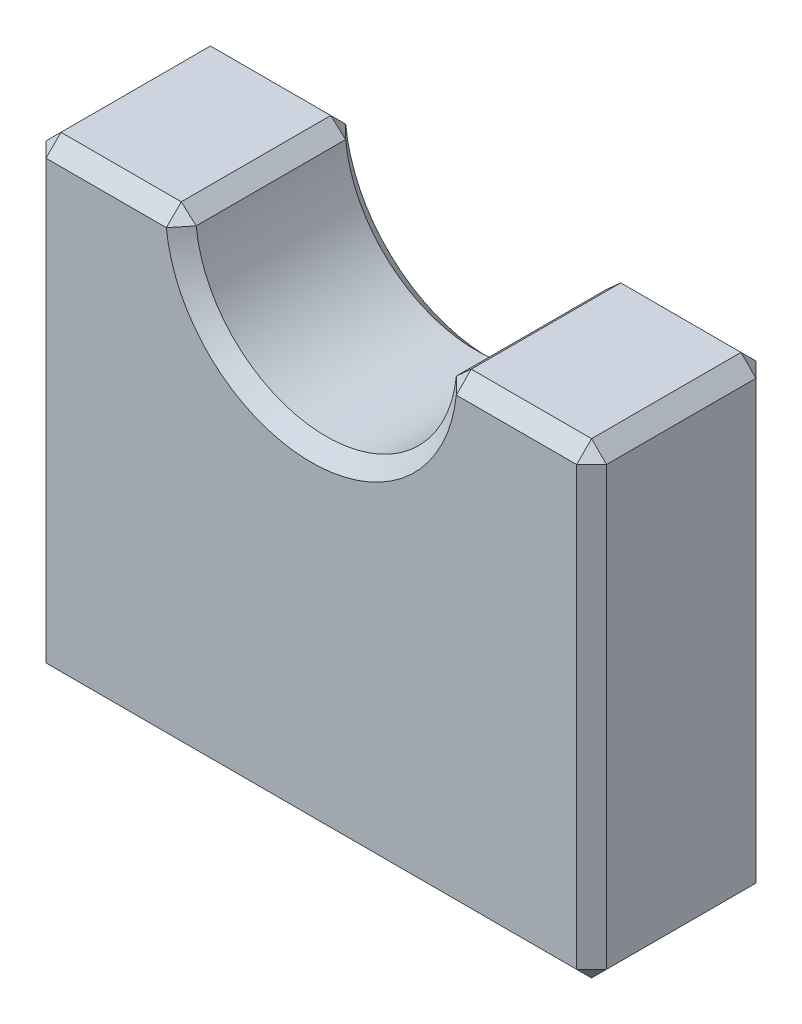
ISO-10303-21;
HEADER;
FILE_DESCRIPTION(('STEP AP214'),'2;1');
FILE_NAME('part.step','',(''),(''),'','','');
FILE_SCHEMA(('AUTOMOTIVE_DESIGN { 1 0 10303 214 1 1 1 1 }'));
ENDSEC;
DATA;
#1=APPLICATION_CONTEXT('core data for automotive mechanical design processes');
#2=APPLICATION_PROTOCOL_DEFINITION('international standard','automotive_design',2000,#1);
#3=PRODUCT_CONTEXT('',#1,'mechanical');
#4=PRODUCT('Part','Part','',(#3));
#5=PRODUCT_RELATED_PRODUCT_CATEGORY('part','',(#4));
#6=PRODUCT_DEFINITION_FORMATION('','',#4);
#7=PRODUCT_DEFINITION_CONTEXT('part definition',#1,'design');
#8=PRODUCT_DEFINITION('design','',#6,#7);
#9=PRODUCT_DEFINITION_SHAPE('','',#8);
#10=(LENGTH_UNIT() NAMED_UNIT(*) SI_UNIT(.MILLI.,.METRE.));
#11=(NAMED_UNIT(*) PLANE_ANGLE_UNIT() SI_UNIT($,.RADIAN.));
#12=(NAMED_UNIT(*) SI_UNIT($,.STERADIAN.) SOLID_ANGLE_UNIT());
#13=UNCERTAINTY_MEASURE_WITH_UNIT(LENGTH_MEASURE(1.E-05),#10,'distance_accuracy_value','');
#14=(GEOMETRIC_REPRESENTATION_CONTEXT(3) GLOBAL_UNCERTAINTY_ASSIGNED_CONTEXT((#13)) GLOBAL_UNIT_ASSIGNED_CONTEXT((#10,
#11,#12)) REPRESENTATION_CONTEXT('',''));
#15=CARTESIAN_POINT('',(0.,0.,0.));
#16=DIRECTION('',(0.,0.,1.));
#17=DIRECTION('',(1.,0.,0.));
#18=AXIS2_PLACEMENT_3D('',#15,#16,#17);
#19=CARTESIAN_POINT('',(0.,0.,12.));
#20=DIRECTION('',(0.,0.,-1.));
#21=DIRECTION('',(-1.,0.,0.));
#22=AXIS2_PLACEMENT_3D('',#19,#20,#21);
#23=CYLINDRICAL_SURFACE('',#22,8.75);
#24=DIRECTION('',(0.,0.,-1.));
#25=VECTOR('',#24,1.);
#26=CARTESIAN_POINT('',(-8.70385597364717,-0.897435897435899,12.));
#27=LINE('',#26,#25);
#28=CARTESIAN_POINT('',(-8.70385597364716,-0.897435897435898,1.));
#29=VERTEX_POINT('',#28);
#30=CARTESIAN_POINT('',(-8.70385597364716,-0.897435897435898,11.));
#31=VERTEX_POINT('',#30);
#32=EDGE_CURVE('E252',#29,#31,#27,.F.);
#33=ORIENTED_EDGE('',*,*,#32,.T.);
#34=CARTESIAN_POINT('',(0.,0.,11.));
#35=DIRECTION('',(0.,0.,1.));
#36=DIRECTION('',(1.,0.,0.));
#37=AXIS2_PLACEMENT_3D('',#34,#35,#36);
#38=CIRCLE('',#37,8.75);
#39=CARTESIAN_POINT('',(8.70385597364716,-0.897435897435899,11.));
#40=VERTEX_POINT('',#39);
#41=EDGE_CURVE('E258',#31,#40,#38,.T.);
#42=ORIENTED_EDGE('',*,*,#41,.T.);
#43=DIRECTION('',(0.,0.,-1.));
#44=VECTOR('',#43,1.);
#45=CARTESIAN_POINT('',(8.70385597364717,-0.897435897435899,12.));
#46=LINE('',#45,#44);
#47=CARTESIAN_POINT('',(8.70385597364716,-0.897435897435899,1.));
#48=VERTEX_POINT('',#47);
#49=EDGE_CURVE('E256',#40,#48,#46,.T.);
#50=ORIENTED_EDGE('',*,*,#49,.T.);
#51=CARTESIAN_POINT('',(0.,0.,1.));
#52=DIRECTION('',(0.,0.,1.));
#53=DIRECTION('',(1.,0.,0.));
#54=AXIS2_PLACEMENT_3D('',#51,#52,#53);
#55=CIRCLE('',#54,8.75);
#56=EDGE_CURVE('E254',#48,#29,#55,.F.);
#57=ORIENTED_EDGE('',*,*,#56,.T.);
#58=EDGE_LOOP('',(#33,#42,#50,#57));
#59=FACE_BOUND('',#58,.T.);
#60=ADVANCED_FACE('F41',(#59),#23,.F.);
#61=CARTESIAN_POINT('',(-8.75,0.,12.));
#62=DIRECTION('',(0.,-1.,0.));
#63=DIRECTION('',(1.,0.,0.));
#64=AXIS2_PLACEMENT_3D('',#61,#62,#63);
#65=PLANE('',#64);
#66=DIRECTION('',(1.,0.,0.));
#67=VECTOR('',#66,1.);
#68=CARTESIAN_POINT('',(-8.75,0.,11.));
#69=LINE('',#68,#67);
#70=CARTESIAN_POINT('',(-17.75,0.,11.));
#71=VERTEX_POINT('',#70);
#72=CARTESIAN_POINT('',(-9.69858237063541,0.,11.));
#73=VERTEX_POINT('',#72);
#74=EDGE_CURVE('E51',#71,#73,#69,.T.);
#75=ORIENTED_EDGE('',*,*,#74,.T.);
#76=DIRECTION('',(0.,0.,-1.));
#77=VECTOR('',#76,1.);
#78=CARTESIAN_POINT('',(-9.69858237063541,0.,12.));
#79=LINE('',#78,#77);
#80=CARTESIAN_POINT('',(-9.69858237063541,0.,1.));
#81=VERTEX_POINT('',#80);
#82=EDGE_CURVE('E11',#73,#81,#79,.T.);
#83=ORIENTED_EDGE('',*,*,#82,.T.);
#84=DIRECTION('',(-1.,0.,0.));
#85=VECTOR('',#84,1.);
#86=CARTESIAN_POINT('',(-8.75,0.,1.));
#87=LINE('',#86,#85);
#88=CARTESIAN_POINT('',(-17.75,0.,1.));
#89=VERTEX_POINT('',#88);
#90=EDGE_CURVE('E270',#81,#89,#87,.T.);
#91=ORIENTED_EDGE('',*,*,#90,.T.);
#92=DIRECTION('',(0.,0.,1.));
#93=VECTOR('',#92,1.);
#94=CARTESIAN_POINT('',(-17.75,0.,12.));
#95=LINE('',#94,#93);
#96=EDGE_CURVE('E62',#89,#71,#95,.T.);
#97=ORIENTED_EDGE('',*,*,#96,.T.);
#98=EDGE_LOOP('',(#75,#83,#91,#97));
#99=FACE_BOUND('',#98,.T.);
#100=ADVANCED_FACE('F408',(#99),#65,.F.);
#101=CARTESIAN_POINT('',(-18.75,0.,12.));
#102=DIRECTION('',(1.,0.,0.));
#103=DIRECTION('',(0.,1.,0.));
#104=AXIS2_PLACEMENT_3D('',#101,#102,#103);
#105=PLANE('',#104);
#106=DIRECTION('',(0.,-1.,0.));
#107=VECTOR('',#106,1.);
#108=CARTESIAN_POINT('',(-18.75,0.,1.));
#109=LINE('',#108,#107);
#110=CARTESIAN_POINT('',(-18.75,-1.,1.));
#111=VERTEX_POINT('',#110);
#112=CARTESIAN_POINT('',(-18.75,-30.25,1.));
#113=VERTEX_POINT('',#112);
#114=EDGE_CURVE('E214',#111,#113,#109,.T.);
#115=ORIENTED_EDGE('',*,*,#114,.T.);
#116=DIRECTION('',(0.,0.,1.));
#117=VECTOR('',#116,1.);
#118=CARTESIAN_POINT('',(-18.75,-30.25,12.));
#119=LINE('',#118,#117);
#120=CARTESIAN_POINT('',(-18.75,-30.25,11.));
#121=VERTEX_POINT('',#120);
#122=EDGE_CURVE('E216',#113,#121,#119,.T.);
#123=ORIENTED_EDGE('',*,*,#122,.T.);
#124=DIRECTION('',(0.,1.,0.));
#125=VECTOR('',#124,1.);
#126=CARTESIAN_POINT('',(-18.75,0.,11.));
#127=LINE('',#126,#125);
#128=CARTESIAN_POINT('',(-18.75,-1.,11.));
#129=VERTEX_POINT('',#128);
#130=EDGE_CURVE('E212',#121,#129,#127,.T.);
#131=ORIENTED_EDGE('',*,*,#130,.T.);
#132=DIRECTION('',(0.,0.,-1.));
#133=VECTOR('',#132,1.);
#134=CARTESIAN_POINT('',(-18.75,-1.,12.));
#135=LINE('',#134,#133);
#136=EDGE_CURVE('E210',#129,#111,#135,.T.);
#137=ORIENTED_EDGE('',*,*,#136,.T.);
#138=EDGE_LOOP('',(#115,#123,#131,#137));
#139=FACE_BOUND('',#138,.T.);
#140=ADVANCED_FACE('F413',(#139),#105,.F.);
#141=CARTESIAN_POINT('',(-18.75,-31.25,12.));
#142=DIRECTION('',(0.,1.,0.));
#143=DIRECTION('',(0.,0.,1.));
#144=AXIS2_PLACEMENT_3D('',#141,#142,#143);
#145=PLANE('',#144);
#146=DIRECTION('',(-1.,0.,0.));
#147=VECTOR('',#146,1.);
#148=CARTESIAN_POINT('',(-18.75,-31.25,11.));
#149=LINE('',#148,#147);
#150=CARTESIAN_POINT('',(17.75,-31.25,11.));
#151=VERTEX_POINT('',#150);
#152=CARTESIAN_POINT('',(-17.75,-31.25,11.));
#153=VERTEX_POINT('',#152);
#154=EDGE_CURVE('E170',#151,#153,#149,.T.);
#155=ORIENTED_EDGE('',*,*,#154,.T.);
#156=DIRECTION('',(0.,0.,-1.));
#157=VECTOR('',#156,1.);
#158=CARTESIAN_POINT('',(-17.75,-31.25,12.));
#159=LINE('',#158,#157);
#160=CARTESIAN_POINT('',(-17.75,-31.25,1.));
#161=VERTEX_POINT('',#160);
#162=EDGE_CURVE('E208',#153,#161,#159,.T.);
#163=ORIENTED_EDGE('',*,*,#162,.T.);
#164=DIRECTION('',(1.,0.,0.));
#165=VECTOR('',#164,1.);
#166=CARTESIAN_POINT('',(-18.75,-31.25,1.));
#167=LINE('',#166,#165);
#168=CARTESIAN_POINT('',(17.75,-31.25,1.));
#169=VERTEX_POINT('',#168);
#170=EDGE_CURVE('E173',#161,#169,#167,.T.);
#171=ORIENTED_EDGE('',*,*,#170,.T.);
#172=DIRECTION('',(0.,0.,1.));
#173=VECTOR('',#172,1.);
#174=CARTESIAN_POINT('',(17.75,-31.25,12.));
#175=LINE('',#174,#173);
#176=EDGE_CURVE('E165',#169,#151,#175,.T.);
#177=ORIENTED_EDGE('',*,*,#176,.T.);
#178=EDGE_LOOP('',(#155,#163,#171,#177));
#179=FACE_BOUND('',#178,.T.);
#180=ADVANCED_FACE('F167',(#179),#145,.F.);
#181=CARTESIAN_POINT('',(18.75,-31.25,12.));
#182=DIRECTION('',(-1.,0.,0.));
#183=DIRECTION('',(0.,-1.,0.));
#184=AXIS2_PLACEMENT_3D('',#181,#182,#183);
#185=PLANE('',#184);
#186=DIRECTION('',(0.,-1.,0.));
#187=VECTOR('',#186,1.);
#188=CARTESIAN_POINT('',(18.75,-31.25,11.));
#189=LINE('',#188,#187);
#190=CARTESIAN_POINT('',(18.75,-1.,11.));
#191=VERTEX_POINT('',#190);
#192=CARTESIAN_POINT('',(18.75,-30.25,11.));
#193=VERTEX_POINT('',#192);
#194=EDGE_CURVE('E234',#191,#193,#189,.T.);
#195=ORIENTED_EDGE('',*,*,#194,.T.);
#196=DIRECTION('',(0.,0.,-1.));
#197=VECTOR('',#196,1.);
#198=CARTESIAN_POINT('',(18.75,-30.25,12.));
#199=LINE('',#198,#197);
#200=CARTESIAN_POINT('',(18.75,-30.25,1.));
#201=VERTEX_POINT('',#200);
#202=EDGE_CURVE('E184',#193,#201,#199,.T.);
#203=ORIENTED_EDGE('',*,*,#202,.T.);
#204=DIRECTION('',(0.,1.,0.));
#205=VECTOR('',#204,1.);
#206=CARTESIAN_POINT('',(18.75,-31.25,1.));
#207=LINE('',#206,#205);
#208=CARTESIAN_POINT('',(18.75,-1.,1.));
#209=VERTEX_POINT('',#208);
#210=EDGE_CURVE('E236',#201,#209,#207,.T.);
#211=ORIENTED_EDGE('',*,*,#210,.T.);
#212=DIRECTION('',(0.,0.,1.));
#213=VECTOR('',#212,1.);
#214=CARTESIAN_POINT('',(18.75,-1.,12.));
#215=LINE('',#214,#213);
#216=EDGE_CURVE('E232',#209,#191,#215,.T.);
#217=ORIENTED_EDGE('',*,*,#216,.T.);
#218=EDGE_LOOP('',(#195,#203,#211,#217));
#219=FACE_BOUND('',#218,.T.);
#220=ADVANCED_FACE('F796',(#219),#185,.F.);
#221=CARTESIAN_POINT('',(18.75,0.,12.));
#222=DIRECTION('',(0.,-1.,0.));
#223=DIRECTION('',(1.,0.,0.));
#224=AXIS2_PLACEMENT_3D('',#221,#222,#223);
#225=PLANE('',#224);
#226=DIRECTION('',(1.,0.,0.));
#227=VECTOR('',#226,1.);
#228=CARTESIAN_POINT('',(18.75,0.,11.));
#229=LINE('',#228,#227);
#230=CARTESIAN_POINT('',(9.69858237063541,0.,11.));
#231=VERTEX_POINT('',#230);
#232=CARTESIAN_POINT('',(17.75,0.,11.));
#233=VERTEX_POINT('',#232);
#234=EDGE_CURVE('E265',#231,#233,#229,.T.);
#235=ORIENTED_EDGE('',*,*,#234,.T.);
#236=DIRECTION('',(0.,0.,-1.));
#237=VECTOR('',#236,1.);
#238=CARTESIAN_POINT('',(17.75,0.,12.));
#239=LINE('',#238,#237);
#240=CARTESIAN_POINT('',(17.75,0.,1.));
#241=VERTEX_POINT('',#240);
#242=EDGE_CURVE('E267',#233,#241,#239,.T.);
#243=ORIENTED_EDGE('',*,*,#242,.T.);
#244=DIRECTION('',(-1.,0.,0.));
#245=VECTOR('',#244,1.);
#246=CARTESIAN_POINT('',(18.75,0.,1.));
#247=LINE('',#246,#245);
#248=CARTESIAN_POINT('',(9.69858237063541,0.,1.));
#249=VERTEX_POINT('',#248);
#250=EDGE_CURVE('E261',#241,#249,#247,.T.);
#251=ORIENTED_EDGE('',*,*,#250,.T.);
#252=DIRECTION('',(0.,0.,1.));
#253=VECTOR('',#252,1.);
#254=CARTESIAN_POINT('',(9.69858237063541,0.,12.));
#255=LINE('',#254,#253);
#256=EDGE_CURVE('E263',#249,#231,#255,.T.);
#257=ORIENTED_EDGE('',*,*,#256,.T.);
#258=EDGE_LOOP('',(#235,#243,#251,#257));
#259=FACE_BOUND('',#258,.T.);
#260=ADVANCED_FACE('F787',(#259),#225,.F.);
#261=CARTESIAN_POINT('',(0.,0.,12.));
#262=DIRECTION('',(0.,0.,1.));
#263=DIRECTION('',(1.,0.,0.));
#264=AXIS2_PLACEMENT_3D('',#261,#262,#263);
#265=PLANE('',#264);
#266=DIRECTION('',(0.,1.,0.));
#267=VECTOR('',#266,1.);
#268=CARTESIAN_POINT('',(17.75,0.,12.));
#269=LINE('',#268,#267);
#270=CARTESIAN_POINT('',(17.75,-30.25,12.));
#271=VERTEX_POINT('',#270);
#272=CARTESIAN_POINT('',(17.75,-1.,12.));
#273=VERTEX_POINT('',#272);
#274=EDGE_CURVE('E247',#271,#273,#269,.T.);
#275=ORIENTED_EDGE('',*,*,#274,.T.);
#276=DIRECTION('',(-1.,0.,0.));
#277=VECTOR('',#276,1.);
#278=CARTESIAN_POINT('',(8.75,-1.,12.));
#279=LINE('',#278,#277);
#280=CARTESIAN_POINT('',(9.69858237063541,-1.,12.));
#281=VERTEX_POINT('',#280);
#282=EDGE_CURVE('E250',#273,#281,#279,.T.);
#283=ORIENTED_EDGE('',*,*,#282,.T.);
#284=CARTESIAN_POINT('',(0.,0.,12.));
#285=DIRECTION('',(0.,0.,1.));
#286=DIRECTION('',(1.,0.,0.));
#287=AXIS2_PLACEMENT_3D('',#284,#285,#286);
#288=CIRCLE('',#287,9.75);
#289=CARTESIAN_POINT('',(-9.69858237063541,-1.,12.));
#290=VERTEX_POINT('',#289);
#291=EDGE_CURVE('E241',#281,#290,#288,.F.);
#292=ORIENTED_EDGE('',*,*,#291,.T.);
#293=DIRECTION('',(-1.,0.,0.));
#294=VECTOR('',#293,1.);
#295=CARTESIAN_POINT('',(-18.75,-1.,12.));
#296=LINE('',#295,#294);
#297=CARTESIAN_POINT('',(-17.75,-1.,12.));
#298=VERTEX_POINT('',#297);
#299=EDGE_CURVE('E239',#290,#298,#296,.T.);
#300=ORIENTED_EDGE('',*,*,#299,.T.);
#301=DIRECTION('',(0.,-1.,0.));
#302=VECTOR('',#301,1.);
#303=CARTESIAN_POINT('',(-17.75,-31.25,12.));
#304=LINE('',#303,#302);
#305=CARTESIAN_POINT('',(-17.75,-30.25,12.));
#306=VERTEX_POINT('',#305);
#307=EDGE_CURVE('E243',#298,#306,#304,.T.);
#308=ORIENTED_EDGE('',*,*,#307,.T.);
#309=DIRECTION('',(1.,0.,0.));
#310=VECTOR('',#309,1.);
#311=CARTESIAN_POINT('',(18.75,-30.25,12.));
#312=LINE('',#311,#310);
#313=EDGE_CURVE('E245',#306,#271,#312,.T.);
#314=ORIENTED_EDGE('',*,*,#313,.T.);
#315=EDGE_LOOP('',(#275,#283,#292,#300,#308,#314));
#316=FACE_BOUND('',#315,.T.);
#317=ADVANCED_FACE('F405',(#316),#265,.T.);
#318=CARTESIAN_POINT('',(0.,0.,0.));
#319=DIRECTION('',(0.,0.,1.));
#320=DIRECTION('',(1.,0.,0.));
#321=AXIS2_PLACEMENT_3D('',#318,#319,#320);
#322=PLANE('',#321);
#323=DIRECTION('',(-1.,0.,0.));
#324=VECTOR('',#323,1.);
#325=CARTESIAN_POINT('',(0.,-30.25,0.));
#326=LINE('',#325,#324);
#327=CARTESIAN_POINT('',(17.75,-30.25,0.));
#328=VERTEX_POINT('',#327);
#329=CARTESIAN_POINT('',(-17.75,-30.25,0.));
#330=VERTEX_POINT('',#329);
#331=EDGE_CURVE('E227',#328,#330,#326,.T.);
#332=ORIENTED_EDGE('',*,*,#331,.T.);
#333=DIRECTION('',(0.,1.,0.));
#334=VECTOR('',#333,1.);
#335=CARTESIAN_POINT('',(-17.75,0.,0.));
#336=LINE('',#335,#334);
#337=CARTESIAN_POINT('',(-17.75,-1.,0.));
#338=VERTEX_POINT('',#337);
#339=EDGE_CURVE('E229',#330,#338,#336,.T.);
#340=ORIENTED_EDGE('',*,*,#339,.T.);
#341=DIRECTION('',(1.,0.,0.));
#342=VECTOR('',#341,1.);
#343=CARTESIAN_POINT('',(0.,-1.,0.));
#344=LINE('',#343,#342);
#345=CARTESIAN_POINT('',(-9.69858237063541,-1.,0.));
#346=VERTEX_POINT('',#345);
#347=EDGE_CURVE('E219',#338,#346,#344,.T.);
#348=ORIENTED_EDGE('',*,*,#347,.T.);
#349=CARTESIAN_POINT('',(0.,0.,0.));
#350=DIRECTION('',(0.,0.,1.));
#351=DIRECTION('',(1.,0.,0.));
#352=AXIS2_PLACEMENT_3D('',#349,#350,#351);
#353=CIRCLE('',#352,9.75);
#354=CARTESIAN_POINT('',(9.69858237063541,-1.,0.));
#355=VERTEX_POINT('',#354);
#356=EDGE_CURVE('E221',#346,#355,#353,.T.);
#357=ORIENTED_EDGE('',*,*,#356,.T.);
#358=DIRECTION('',(1.,0.,0.));
#359=VECTOR('',#358,1.);
#360=CARTESIAN_POINT('',(0.,-1.,0.));
#361=LINE('',#360,#359);
#362=CARTESIAN_POINT('',(17.75,-1.,0.));
#363=VERTEX_POINT('',#362);
#364=EDGE_CURVE('E223',#355,#363,#361,.T.);
#365=ORIENTED_EDGE('',*,*,#364,.T.);
#366=DIRECTION('',(0.,-1.,0.));
#367=VECTOR('',#366,1.);
#368=CARTESIAN_POINT('',(17.75,0.,0.));
#369=LINE('',#368,#367);
#370=EDGE_CURVE('E225',#363,#328,#369,.T.);
#371=ORIENTED_EDGE('',*,*,#370,.T.);
#372=EDGE_LOOP('',(#332,#340,#348,#357,#365,#371));
#373=FACE_BOUND('',#372,.T.);
#374=ADVANCED_FACE('F371',(#373),#322,.F.);
#375=CARTESIAN_POINT('',(8.70385597364716,-0.897435897435899,12.));
#376=DIRECTION('',(0.669864127057083,-0.742483704388219,0.));
#377=DIRECTION('',(0.,0.,-1.));
#378=AXIS2_PLACEMENT_3D('',#375,#376,#377);
#379=PLANE('',#378);
#380=DIRECTION('',(0.742483704388219,0.669864127057083,0.));
#381=VECTOR('',#380,1.);
#382=CARTESIAN_POINT('',(8.70385597364716,-0.897435897435899,11.));
#383=LINE('',#382,#381);
#384=EDGE_CURVE('E46',#231,#40,#383,.F.);
#385=ORIENTED_EDGE('',*,*,#384,.F.);
#386=ORIENTED_EDGE('',*,*,#256,.F.);
#387=DIRECTION('',(-0.742483704388219,-0.669864127057083,0.));
#388=VECTOR('',#387,1.);
#389=CARTESIAN_POINT('',(8.70385597364716,-0.897435897435899,1.));
#390=LINE('',#389,#388);
#391=EDGE_CURVE('E205',#48,#249,#390,.F.);
#392=ORIENTED_EDGE('',*,*,#391,.F.);
#393=ORIENTED_EDGE('',*,*,#49,.F.);
#394=EDGE_LOOP('',(#385,#386,#392,#393));
#395=FACE_BOUND('',#394,.T.);
#396=ADVANCED_FACE('F44',(#395),#379,.F.);
#397=CARTESIAN_POINT('',(8.70385597364716,-0.897435897435899,11.));
#398=DIRECTION('',(-0.537825434827237,0.596130774936546,0.596130774936546));
#399=DIRECTION('',(0.,-0.707106781186548,0.707106781186548));
#400=AXIS2_PLACEMENT_3D('',#397,#398,#399);
#401=PLANE('',#400);
#402=DIRECTION('',(0.,0.707106781186547,-0.707106781186547));
#403=VECTOR('',#402,1.);
#404=CARTESIAN_POINT('',(9.69858237063541,-0.44871794871795,11.4487179487179));
#405=LINE('',#404,#403);
#406=EDGE_CURVE('E350',#231,#281,#405,.F.);
#407=ORIENTED_EDGE('',*,*,#406,.F.);
#408=ORIENTED_EDGE('',*,*,#384,.T.);
#409=DIRECTION('',(-0.703377780735651,0.07252377242939,-0.707106781186547));
#410=VECTOR('',#409,1.);
#411=CARTESIAN_POINT('',(0.,0.,2.25));
#412=LINE('',#411,#410);
#413=EDGE_CURVE('E353',#281,#40,#412,.T.);
#414=ORIENTED_EDGE('',*,*,#413,.F.);
#415=EDGE_LOOP('',(#407,#408,#414));
#416=FACE_BOUND('',#415,.T.);
#417=ADVANCED_FACE('F398',(#416),#401,.T.);
#418=CARTESIAN_POINT('',(8.70385597364716,-0.897435897435899,1.));
#419=DIRECTION('',(-0.537825434827237,0.596130774936546,-0.596130774936546));
#420=DIRECTION('',(0.,0.707106781186548,0.707106781186548));
#421=AXIS2_PLACEMENT_3D('',#418,#419,#420);
#422=PLANE('',#421);
#423=DIRECTION('',(0.703377780735651,-0.07252377242939,-0.707106781186547));
#424=VECTOR('',#423,1.);
#425=CARTESIAN_POINT('',(0.,0.,9.75));
#426=LINE('',#425,#424);
#427=EDGE_CURVE('E344',#48,#355,#426,.T.);
#428=ORIENTED_EDGE('',*,*,#427,.F.);
#429=ORIENTED_EDGE('',*,*,#391,.T.);
#430=DIRECTION('',(0.,0.707106781186547,0.707106781186547));
#431=VECTOR('',#430,1.);
#432=CARTESIAN_POINT('',(9.69858237063541,-0.448717948717949,0.551282051282052));
#433=LINE('',#432,#431);
#434=EDGE_CURVE('E347',#355,#249,#433,.T.);
#435=ORIENTED_EDGE('',*,*,#434,.F.);
#436=EDGE_LOOP('',(#428,#429,#435));
#437=FACE_BOUND('',#436,.T.);
#438=ADVANCED_FACE('F359',(#437),#422,.T.);
#439=CARTESIAN_POINT('',(0.,0.,12.));
#440=DIRECTION('',(0.,0.,1.));
#441=DIRECTION('',(1.,0.,0.));
#442=AXIS2_PLACEMENT_3D('',#439,#440,#441);
#443=CONICAL_SURFACE('',#442,9.75,0.785398163397448);
#444=ORIENTED_EDGE('',*,*,#413,.T.);
#445=ORIENTED_EDGE('',*,*,#41,.F.);
#446=DIRECTION('',(-0.703377780735651,-0.07252377242939,0.707106781186547));
#447=VECTOR('',#446,1.);
#448=CARTESIAN_POINT('',(0.,0.,2.25));
#449=LINE('',#448,#447);
#450=EDGE_CURVE('E338',#290,#31,#449,.F.);
#451=ORIENTED_EDGE('',*,*,#450,.F.);
#452=ORIENTED_EDGE('',*,*,#291,.F.);
#453=EDGE_LOOP('',(#444,#445,#451,#452));
#454=FACE_BOUND('',#453,.T.);
#455=ADVANCED_FACE('F393',(#454),#443,.F.);
#456=CARTESIAN_POINT('',(0.,-1.,12.));
#457=DIRECTION('',(0.,0.707106781186547,0.707106781186547));
#458=DIRECTION('',(1.,0.,0.));
#459=AXIS2_PLACEMENT_3D('',#456,#457,#458);
#460=PLANE('',#459);
#461=ORIENTED_EDGE('',*,*,#406,.T.);
#462=ORIENTED_EDGE('',*,*,#282,.F.);
#463=DIRECTION('',(0.,-0.707106781186547,0.707106781186547));
#464=VECTOR('',#463,1.);
#465=CARTESIAN_POINT('',(17.75,-1.,12.));
#466=LINE('',#465,#464);
#467=EDGE_CURVE('E335',#233,#273,#466,.T.);
#468=ORIENTED_EDGE('',*,*,#467,.F.);
#469=ORIENTED_EDGE('',*,*,#234,.F.);
#470=EDGE_LOOP('',(#461,#462,#468,#469));
#471=FACE_BOUND('',#470,.T.);
#472=ADVANCED_FACE('F578',(#471),#460,.T.);
#473=CARTESIAN_POINT('',(17.75,0.,12.));
#474=DIRECTION('',(-0.707106781186547,-0.707106781186548,0.));
#475=DIRECTION('',(0.,0.,-1.));
#476=AXIS2_PLACEMENT_3D('',#473,#474,#475);
#477=PLANE('',#476);
#478=DIRECTION('',(-0.707106781186548,0.707106781186547,0.));
#479=VECTOR('',#478,1.);
#480=CARTESIAN_POINT('',(18.75,-1.,1.));
#481=LINE('',#480,#479);
#482=EDGE_CURVE('E329',#241,#209,#481,.F.);
#483=ORIENTED_EDGE('',*,*,#482,.F.);
#484=ORIENTED_EDGE('',*,*,#242,.F.);
#485=DIRECTION('',(0.707106781186548,-0.707106781186547,0.));
#486=VECTOR('',#485,1.);
#487=CARTESIAN_POINT('',(18.25,-0.500000000000003,11.));
#488=LINE('',#487,#486);
#489=EDGE_CURVE('E332',#191,#233,#488,.F.);
#490=ORIENTED_EDGE('',*,*,#489,.F.);
#491=ORIENTED_EDGE('',*,*,#216,.F.);
#492=EDGE_LOOP('',(#483,#484,#490,#491));
#493=FACE_BOUND('',#492,.T.);
#494=ADVANCED_FACE('F572',(#493),#477,.F.);
#495=CARTESIAN_POINT('',(18.75,0.,1.));
#496=DIRECTION('',(0.,-0.707106781186547,0.707106781186547));
#497=DIRECTION('',(-1.,0.,0.));
#498=AXIS2_PLACEMENT_3D('',#495,#496,#497);
#499=PLANE('',#498);
#500=ORIENTED_EDGE('',*,*,#434,.T.);
#501=ORIENTED_EDGE('',*,*,#250,.F.);
#502=DIRECTION('',(0.,-0.707106781186547,-0.707106781186547));
#503=VECTOR('',#502,1.);
#504=CARTESIAN_POINT('',(17.75,-0.500000000000003,0.499999999999999));
#505=LINE('',#504,#503);
#506=EDGE_CURVE('E327',#363,#241,#505,.F.);
#507=ORIENTED_EDGE('',*,*,#506,.F.);
#508=ORIENTED_EDGE('',*,*,#364,.F.);
#509=EDGE_LOOP('',(#500,#501,#507,#508));
#510=FACE_BOUND('',#509,.T.);
#511=ADVANCED_FACE('F367',(#510),#499,.F.);
#512=CARTESIAN_POINT('',(0.,0.,1.));
#513=DIRECTION('',(0.,0.,-1.));
#514=DIRECTION('',(-1.,0.,0.));
#515=AXIS2_PLACEMENT_3D('',#512,#513,#514);
#516=CONICAL_SURFACE('',#515,8.75,0.785398163397448);
#517=ORIENTED_EDGE('',*,*,#427,.T.);
#518=ORIENTED_EDGE('',*,*,#356,.F.);
#519=DIRECTION('',(0.703377780735651,0.07252377242939,0.707106781186547));
#520=VECTOR('',#519,1.);
#521=CARTESIAN_POINT('',(0.,0.,9.75));
#522=LINE('',#521,#520);
#523=EDGE_CURVE('E324',#29,#346,#522,.F.);
#524=ORIENTED_EDGE('',*,*,#523,.F.);
#525=ORIENTED_EDGE('',*,*,#56,.F.);
#526=EDGE_LOOP('',(#517,#518,#524,#525));
#527=FACE_BOUND('',#526,.T.);
#528=ADVANCED_FACE('F378',(#527),#516,.F.);
#529=CARTESIAN_POINT('',(-9.69858237063541,0.,12.));
#530=DIRECTION('',(-0.669864127057083,-0.742483704388219,0.));
#531=DIRECTION('',(0.,0.,-1.));
#532=AXIS2_PLACEMENT_3D('',#529,#530,#531);
#533=PLANE('',#532);
#534=DIRECTION('',(0.742483704388219,-0.669864127057083,0.));
#535=VECTOR('',#534,1.);
#536=CARTESIAN_POINT('',(-9.20121917214129,-0.448717948717949,11.));
#537=LINE('',#536,#535);
#538=EDGE_CURVE('E341',#31,#73,#537,.F.);
#539=ORIENTED_EDGE('',*,*,#538,.F.);
#540=ORIENTED_EDGE('',*,*,#32,.F.);
#541=DIRECTION('',(-0.742483704388219,0.669864127057083,0.));
#542=VECTOR('',#541,1.);
#543=CARTESIAN_POINT('',(-8.70385597364716,-0.897435897435898,1.));
#544=LINE('',#543,#542);
#545=EDGE_CURVE('E321',#81,#29,#544,.F.);
#546=ORIENTED_EDGE('',*,*,#545,.F.);
#547=ORIENTED_EDGE('',*,*,#82,.F.);
#548=EDGE_LOOP('',(#539,#540,#546,#547));
#549=FACE_BOUND('',#548,.T.);
#550=ADVANCED_FACE('F385',(#549),#533,.F.);
#551=CARTESIAN_POINT('',(-9.69858237063541,-1.,12.));
#552=DIRECTION('',(0.537825434827237,0.596130774936546,0.596130774936546));
#553=DIRECTION('',(0.,-0.707106781186547,0.707106781186548));
#554=AXIS2_PLACEMENT_3D('',#551,#552,#553);
#555=PLANE('',#554);
#556=ORIENTED_EDGE('',*,*,#450,.T.);
#557=ORIENTED_EDGE('',*,*,#538,.T.);
#558=DIRECTION('',(0.,-0.707106781186547,0.707106781186547));
#559=VECTOR('',#558,1.);
#560=CARTESIAN_POINT('',(-9.69858237063541,-1.,12.));
#561=LINE('',#560,#559);
#562=EDGE_CURVE('E318',#290,#73,#561,.F.);
#563=ORIENTED_EDGE('',*,*,#562,.F.);
#564=EDGE_LOOP('',(#556,#557,#563));
#565=FACE_BOUND('',#564,.T.);
#566=ADVANCED_FACE('F389',(#565),#555,.T.);
#567=CARTESIAN_POINT('',(17.75,-1.,12.));
#568=DIRECTION('',(0.577350269189626,0.577350269189627,0.577350269189625));
#569=DIRECTION('',(-0.707106781186548,0.707106781186547,0.));
#570=AXIS2_PLACEMENT_3D('',#567,#568,#569);
#571=PLANE('',#570);
#572=ORIENTED_EDGE('',*,*,#489,.T.);
#573=ORIENTED_EDGE('',*,*,#467,.T.);
#574=DIRECTION('',(0.707106781186546,0.,-0.707106781186549));
#575=VECTOR('',#574,1.);
#576=CARTESIAN_POINT('',(17.75,-1.,12.));
#577=LINE('',#576,#575);
#578=EDGE_CURVE('E316',#191,#273,#577,.F.);
#579=ORIENTED_EDGE('',*,*,#578,.F.);
#580=EDGE_LOOP('',(#572,#573,#579));
#581=FACE_BOUND('',#580,.T.);
#582=ADVANCED_FACE('F544',(#581),#571,.T.);
#583=CARTESIAN_POINT('',(18.75,-1.,1.));
#584=DIRECTION('',(0.577350269189626,0.577350269189627,-0.577350269189625));
#585=DIRECTION('',(-0.707106781186548,0.707106781186547,0.));
#586=AXIS2_PLACEMENT_3D('',#583,#584,#585);
#587=PLANE('',#586);
#588=ORIENTED_EDGE('',*,*,#506,.T.);
#589=ORIENTED_EDGE('',*,*,#482,.T.);
#590=DIRECTION('',(0.707106781186546,0.,0.707106781186549));
#591=VECTOR('',#590,1.);
#592=CARTESIAN_POINT('',(18.75,-1.,1.));
#593=LINE('',#592,#591);
#594=EDGE_CURVE('E313',#363,#209,#593,.T.);
#595=ORIENTED_EDGE('',*,*,#594,.F.);
#596=EDGE_LOOP('',(#588,#589,#595));
#597=FACE_BOUND('',#596,.T.);
#598=ADVANCED_FACE('F537',(#597),#587,.T.);
#599=CARTESIAN_POINT('',(-8.70385597364716,-0.897435897435898,1.));
#600=DIRECTION('',(0.537825434827237,0.596130774936546,-0.596130774936546));
#601=DIRECTION('',(0.,0.707106781186547,0.707106781186548));
#602=AXIS2_PLACEMENT_3D('',#599,#600,#601);
#603=PLANE('',#602);
#604=ORIENTED_EDGE('',*,*,#545,.T.);
#605=ORIENTED_EDGE('',*,*,#523,.T.);
#606=DIRECTION('',(0.,-0.707106781186547,-0.707106781186547));
#607=VECTOR('',#606,1.);
#608=CARTESIAN_POINT('',(-9.69858237063541,-0.44871794871795,0.551282051282052));
#609=LINE('',#608,#607);
#610=EDGE_CURVE('E310',#81,#346,#609,.T.);
#611=ORIENTED_EDGE('',*,*,#610,.F.);
#612=EDGE_LOOP('',(#604,#605,#611));
#613=FACE_BOUND('',#612,.T.);
#614=ADVANCED_FACE('F530',(#613),#603,.T.);
#615=CARTESIAN_POINT('',(0.,-1.,12.));
#616=DIRECTION('',(0.,0.707106781186547,0.707106781186547));
#617=DIRECTION('',(1.,0.,0.));
#618=AXIS2_PLACEMENT_3D('',#615,#616,#617);
#619=PLANE('',#618);
#620=ORIENTED_EDGE('',*,*,#562,.T.);
#621=ORIENTED_EDGE('',*,*,#74,.F.);
#622=DIRECTION('',(0.,0.707106781186547,-0.707106781186547));
#623=VECTOR('',#622,1.);
#624=CARTESIAN_POINT('',(-17.75,-0.500000000000001,11.5));
#625=LINE('',#624,#623);
#626=EDGE_CURVE('E304',#298,#71,#625,.T.);
#627=ORIENTED_EDGE('',*,*,#626,.F.);
#628=ORIENTED_EDGE('',*,*,#299,.F.);
#629=EDGE_LOOP('',(#620,#621,#627,#628));
#630=FACE_BOUND('',#629,.T.);
#631=ADVANCED_FACE('F523',(#630),#619,.T.);
#632=CARTESIAN_POINT('',(17.75,0.,12.));
#633=DIRECTION('',(0.707106781186549,0.,0.707106781186546));
#634=DIRECTION('',(0.,-1.,0.));
#635=AXIS2_PLACEMENT_3D('',#632,#633,#634);
#636=PLANE('',#635);
#637=ORIENTED_EDGE('',*,*,#578,.T.);
#638=ORIENTED_EDGE('',*,*,#274,.F.);
#639=DIRECTION('',(-0.707106781186546,0.,0.707106781186549));
#640=VECTOR('',#639,1.);
#641=CARTESIAN_POINT('',(18.25,-30.25,11.5));
#642=LINE('',#641,#640);
#643=EDGE_CURVE('E188',#193,#271,#642,.T.);
#644=ORIENTED_EDGE('',*,*,#643,.F.);
#645=ORIENTED_EDGE('',*,*,#194,.F.);
#646=EDGE_LOOP('',(#637,#638,#644,#645));
#647=FACE_BOUND('',#646,.T.);
#648=ADVANCED_FACE('F517',(#647),#636,.T.);
#649=CARTESIAN_POINT('',(18.75,-30.25,12.));
#650=DIRECTION('',(-0.707106781186547,0.707106781186547,0.));
#651=DIRECTION('',(0.,0.,-1.));
#652=AXIS2_PLACEMENT_3D('',#649,#650,#651);
#653=PLANE('',#652);
#654=DIRECTION('',(0.707106781186547,0.707106781186547,0.));
#655=VECTOR('',#654,1.);
#656=CARTESIAN_POINT('',(17.75,-31.25,1.));
#657=LINE('',#656,#655);
#658=EDGE_CURVE('E189',#201,#169,#657,.F.);
#659=ORIENTED_EDGE('',*,*,#658,.F.);
#660=ORIENTED_EDGE('',*,*,#202,.F.);
#661=DIRECTION('',(-0.707106781186547,-0.707106781186547,0.));
#662=VECTOR('',#661,1.);
#663=CARTESIAN_POINT('',(17.75,-31.25,11.));
#664=LINE('',#663,#662);
#665=EDGE_CURVE('E180',#151,#193,#664,.F.);
#666=ORIENTED_EDGE('',*,*,#665,.F.);
#667=ORIENTED_EDGE('',*,*,#176,.F.);
#668=EDGE_LOOP('',(#659,#660,#666,#667));
#669=FACE_BOUND('',#668,.T.);
#670=ADVANCED_FACE('F182',(#669),#653,.F.);
#671=CARTESIAN_POINT('',(18.75,-31.25,1.));
#672=DIRECTION('',(-0.707106781186549,0.,0.707106781186546));
#673=DIRECTION('',(0.,1.,0.));
#674=AXIS2_PLACEMENT_3D('',#671,#672,#673);
#675=PLANE('',#674);
#676=ORIENTED_EDGE('',*,*,#594,.T.);
#677=ORIENTED_EDGE('',*,*,#210,.F.);
#678=DIRECTION('',(-0.707106781186546,0.,-0.707106781186549));
#679=VECTOR('',#678,1.);
#680=CARTESIAN_POINT('',(18.25,-30.25,0.5));
#681=LINE('',#680,#679);
#682=EDGE_CURVE('E300',#328,#201,#681,.F.);
#683=ORIENTED_EDGE('',*,*,#682,.F.);
#684=ORIENTED_EDGE('',*,*,#370,.F.);
#685=EDGE_LOOP('',(#676,#677,#683,#684));
#686=FACE_BOUND('',#685,.T.);
#687=ADVANCED_FACE('F504',(#686),#675,.F.);
#688=CARTESIAN_POINT('',(-8.75,0.,1.));
#689=DIRECTION('',(0.,-0.707106781186547,0.707106781186547));
#690=DIRECTION('',(-1.,0.,0.));
#691=AXIS2_PLACEMENT_3D('',#688,#689,#690);
#692=PLANE('',#691);
#693=ORIENTED_EDGE('',*,*,#610,.T.);
#694=ORIENTED_EDGE('',*,*,#347,.F.);
#695=DIRECTION('',(0.,0.707106781186547,0.707106781186547));
#696=VECTOR('',#695,1.);
#697=CARTESIAN_POINT('',(-17.75,-1.,0.));
#698=LINE('',#697,#696);
#699=EDGE_CURVE('E297',#89,#338,#698,.F.);
#700=ORIENTED_EDGE('',*,*,#699,.F.);
#701=ORIENTED_EDGE('',*,*,#90,.F.);
#702=EDGE_LOOP('',(#693,#694,#700,#701));
#703=FACE_BOUND('',#702,.T.);
#704=ADVANCED_FACE('F497',(#703),#692,.F.);
#705=CARTESIAN_POINT('',(-18.75,-1.,12.));
#706=DIRECTION('',(0.707106781186548,-0.707106781186547,0.));
#707=DIRECTION('',(0.,0.,-1.));
#708=AXIS2_PLACEMENT_3D('',#705,#706,#707);
#709=PLANE('',#708);
#710=DIRECTION('',(0.707106781186547,0.707106781186548,0.));
#711=VECTOR('',#710,1.);
#712=CARTESIAN_POINT('',(-18.75,-1.,11.));
#713=LINE('',#712,#711);
#714=EDGE_CURVE('E307',#71,#129,#713,.F.);
#715=ORIENTED_EDGE('',*,*,#714,.F.);
#716=ORIENTED_EDGE('',*,*,#96,.F.);
#717=DIRECTION('',(-0.707106781186547,-0.707106781186548,0.));
#718=VECTOR('',#717,1.);
#719=CARTESIAN_POINT('',(-18.25,-0.500000000000002,1.));
#720=LINE('',#719,#718);
#721=EDGE_CURVE('E294',#111,#89,#720,.F.);
#722=ORIENTED_EDGE('',*,*,#721,.F.);
#723=ORIENTED_EDGE('',*,*,#136,.F.);
#724=EDGE_LOOP('',(#715,#716,#722,#723));
#725=FACE_BOUND('',#724,.T.);
#726=ADVANCED_FACE('F490',(#725),#709,.F.);
#727=CARTESIAN_POINT('',(-18.75,-1.,11.));
#728=DIRECTION('',(-0.577350269189626,0.577350269189626,0.577350269189626));
#729=DIRECTION('',(0.707106781186547,0.,0.707106781186547));
#730=AXIS2_PLACEMENT_3D('',#727,#728,#729);
#731=PLANE('',#730);
#732=ORIENTED_EDGE('',*,*,#626,.T.);
#733=ORIENTED_EDGE('',*,*,#714,.T.);
#734=DIRECTION('',(0.707106781186548,0.,0.707106781186548));
#735=VECTOR('',#734,1.);
#736=CARTESIAN_POINT('',(-18.75,-1.,11.));
#737=LINE('',#736,#735);
#738=EDGE_CURVE('E196',#298,#129,#737,.F.);
#739=ORIENTED_EDGE('',*,*,#738,.F.);
#740=EDGE_LOOP('',(#732,#733,#739));
#741=FACE_BOUND('',#740,.T.);
#742=ADVANCED_FACE('F484',(#741),#731,.T.);
#743=CARTESIAN_POINT('',(17.75,-31.25,11.));
#744=DIRECTION('',(0.577350269189626,-0.577350269189626,0.577350269189624));
#745=DIRECTION('',(0.707106781186547,0.707106781186547,0.));
#746=AXIS2_PLACEMENT_3D('',#743,#744,#745);
#747=PLANE('',#746);
#748=ORIENTED_EDGE('',*,*,#665,.T.);
#749=ORIENTED_EDGE('',*,*,#643,.T.);
#750=DIRECTION('',(0.,-0.707106781186548,-0.707106781186548));
#751=VECTOR('',#750,1.);
#752=CARTESIAN_POINT('',(17.75,-31.25,11.));
#753=LINE('',#752,#751);
#754=EDGE_CURVE('E192',#151,#271,#753,.F.);
#755=ORIENTED_EDGE('',*,*,#754,.F.);
#756=EDGE_LOOP('',(#748,#749,#755));
#757=FACE_BOUND('',#756,.T.);
#758=ADVANCED_FACE('F193',(#757),#747,.T.);
#759=CARTESIAN_POINT('',(17.75,-31.25,1.));
#760=DIRECTION('',(0.577350269189626,-0.577350269189626,-0.577350269189624));
#761=DIRECTION('',(0.707106781186547,0.707106781186547,0.));
#762=AXIS2_PLACEMENT_3D('',#759,#760,#761);
#763=PLANE('',#762);
#764=ORIENTED_EDGE('',*,*,#682,.T.);
#765=ORIENTED_EDGE('',*,*,#658,.T.);
#766=DIRECTION('',(0.,-0.707106781186548,0.707106781186548));
#767=VECTOR('',#766,1.);
#768=CARTESIAN_POINT('',(17.75,-31.25,1.));
#769=LINE('',#768,#767);
#770=EDGE_CURVE('E197',#328,#169,#769,.T.);
#771=ORIENTED_EDGE('',*,*,#770,.F.);
#772=EDGE_LOOP('',(#764,#765,#771));
#773=FACE_BOUND('',#772,.T.);
#774=ADVANCED_FACE('F471',(#773),#763,.T.);
#775=CARTESIAN_POINT('',(-17.75,-1.,0.));
#776=DIRECTION('',(-0.577350269189626,0.577350269189626,-0.577350269189626));
#777=DIRECTION('',(-0.707106781186547,0.,0.707106781186547));
#778=AXIS2_PLACEMENT_3D('',#775,#776,#777);
#779=PLANE('',#778);
#780=ORIENTED_EDGE('',*,*,#721,.T.);
#781=ORIENTED_EDGE('',*,*,#699,.T.);
#782=DIRECTION('',(0.707106781186548,0.,-0.707106781186548));
#783=VECTOR('',#782,1.);
#784=CARTESIAN_POINT('',(-17.75,-1.,0.));
#785=LINE('',#784,#783);
#786=EDGE_CURVE('E288',#111,#338,#785,.T.);
#787=ORIENTED_EDGE('',*,*,#786,.F.);
#788=EDGE_LOOP('',(#780,#781,#787));
#789=FACE_BOUND('',#788,.T.);
#790=ADVANCED_FACE('F464',(#789),#779,.T.);
#791=CARTESIAN_POINT('',(-17.75,0.,12.));
#792=DIRECTION('',(-0.707106781186547,0.,0.707106781186547));
#793=DIRECTION('',(0.,1.,0.));
#794=AXIS2_PLACEMENT_3D('',#791,#792,#793);
#795=PLANE('',#794);
#796=ORIENTED_EDGE('',*,*,#738,.T.);
#797=ORIENTED_EDGE('',*,*,#130,.F.);
#798=DIRECTION('',(-0.707106781186547,0.,-0.707106781186547));
#799=VECTOR('',#798,1.);
#800=CARTESIAN_POINT('',(-18.75,-30.25,11.));
#801=LINE('',#800,#799);
#802=EDGE_CURVE('E285',#306,#121,#801,.T.);
#803=ORIENTED_EDGE('',*,*,#802,.F.);
#804=ORIENTED_EDGE('',*,*,#307,.F.);
#805=EDGE_LOOP('',(#796,#797,#803,#804));
#806=FACE_BOUND('',#805,.T.);
#807=ADVANCED_FACE('F458',(#806),#795,.T.);
#808=CARTESIAN_POINT('',(0.,-30.25,12.));
#809=DIRECTION('',(0.,-0.707106781186547,0.707106781186547));
#810=DIRECTION('',(-1.,0.,0.));
#811=AXIS2_PLACEMENT_3D('',#808,#809,#810);
#812=PLANE('',#811);
#813=ORIENTED_EDGE('',*,*,#754,.T.);
#814=ORIENTED_EDGE('',*,*,#313,.F.);
#815=DIRECTION('',(0.,0.707106781186547,0.707106781186547));
#816=VECTOR('',#815,1.);
#817=CARTESIAN_POINT('',(-17.75,-30.75,11.5));
#818=LINE('',#817,#816);
#819=EDGE_CURVE('E201',#153,#306,#818,.T.);
#820=ORIENTED_EDGE('',*,*,#819,.F.);
#821=ORIENTED_EDGE('',*,*,#154,.F.);
#822=EDGE_LOOP('',(#813,#814,#820,#821));
#823=FACE_BOUND('',#822,.T.);
#824=ADVANCED_FACE('F199',(#823),#812,.T.);
#825=CARTESIAN_POINT('',(-18.75,-31.25,1.));
#826=DIRECTION('',(0.,0.707106781186547,0.707106781186547));
#827=DIRECTION('',(1.,0.,0.));
#828=AXIS2_PLACEMENT_3D('',#825,#826,#827);
#829=PLANE('',#828);
#830=ORIENTED_EDGE('',*,*,#770,.T.);
#831=ORIENTED_EDGE('',*,*,#170,.F.);
#832=DIRECTION('',(0.,0.707106781186547,-0.707106781186547));
#833=VECTOR('',#832,1.);
#834=CARTESIAN_POINT('',(-17.75,-31.25,1.));
#835=LINE('',#834,#833);
#836=EDGE_CURVE('E281',#330,#161,#835,.F.);
#837=ORIENTED_EDGE('',*,*,#836,.F.);
#838=ORIENTED_EDGE('',*,*,#331,.F.);
#839=EDGE_LOOP('',(#830,#831,#837,#838));
#840=FACE_BOUND('',#839,.T.);
#841=ADVANCED_FACE('F445',(#840),#829,.F.);
#842=CARTESIAN_POINT('',(-18.75,0.,1.));
#843=DIRECTION('',(0.707106781186547,0.,0.707106781186547));
#844=DIRECTION('',(0.,-1.,0.));
#845=AXIS2_PLACEMENT_3D('',#842,#843,#844);
#846=PLANE('',#845);
#847=ORIENTED_EDGE('',*,*,#786,.T.);
#848=ORIENTED_EDGE('',*,*,#339,.F.);
#849=DIRECTION('',(-0.707106781186547,0.,0.707106781186547));
#850=VECTOR('',#849,1.);
#851=CARTESIAN_POINT('',(-18.25,-30.25,0.5));
#852=LINE('',#851,#850);
#853=EDGE_CURVE('E278',#113,#330,#852,.F.);
#854=ORIENTED_EDGE('',*,*,#853,.F.);
#855=ORIENTED_EDGE('',*,*,#114,.F.);
#856=EDGE_LOOP('',(#847,#848,#854,#855));
#857=FACE_BOUND('',#856,.T.);
#858=ADVANCED_FACE('F438',(#857),#846,.F.);
#859=CARTESIAN_POINT('',(-18.75,-30.25,11.));
#860=DIRECTION('',(-0.577350269189626,-0.577350269189626,0.577350269189626));
#861=DIRECTION('',(0.707106781186547,0.,0.707106781186547));
#862=AXIS2_PLACEMENT_3D('',#859,#860,#861);
#863=PLANE('',#862);
#864=ORIENTED_EDGE('',*,*,#819,.T.);
#865=ORIENTED_EDGE('',*,*,#802,.T.);
#866=DIRECTION('',(-0.707106781186547,0.707106781186547,0.));
#867=VECTOR('',#866,1.);
#868=CARTESIAN_POINT('',(-18.75,-30.25,11.));
#869=LINE('',#868,#867);
#870=EDGE_CURVE('E276',#153,#121,#869,.T.);
#871=ORIENTED_EDGE('',*,*,#870,.F.);
#872=EDGE_LOOP('',(#864,#865,#871));
#873=FACE_BOUND('',#872,.T.);
#874=ADVANCED_FACE('F431',(#873),#863,.T.);
#875=CARTESIAN_POINT('',(-17.75,-31.25,1.));
#876=DIRECTION('',(-0.577350269189626,-0.577350269189626,-0.577350269189626));
#877=DIRECTION('',(-0.707106781186547,0.,0.707106781186547));
#878=AXIS2_PLACEMENT_3D('',#875,#876,#877);
#879=PLANE('',#878);
#880=ORIENTED_EDGE('',*,*,#853,.T.);
#881=ORIENTED_EDGE('',*,*,#836,.T.);
#882=DIRECTION('',(0.707106781186547,-0.707106781186547,0.));
#883=VECTOR('',#882,1.);
#884=CARTESIAN_POINT('',(-17.75,-31.25,1.));
#885=LINE('',#884,#883);
#886=EDGE_CURVE('E274',#113,#161,#885,.T.);
#887=ORIENTED_EDGE('',*,*,#886,.F.);
#888=EDGE_LOOP('',(#880,#881,#887));
#889=FACE_BOUND('',#888,.T.);
#890=ADVANCED_FACE('F424',(#889),#879,.T.);
#891=CARTESIAN_POINT('',(-17.75,-31.25,12.));
#892=DIRECTION('',(0.707106781186547,0.707106781186547,0.));
#893=DIRECTION('',(0.,0.,-1.));
#894=AXIS2_PLACEMENT_3D('',#891,#892,#893);
#895=PLANE('',#894);
#896=ORIENTED_EDGE('',*,*,#870,.T.);
#897=ORIENTED_EDGE('',*,*,#122,.F.);
#898=ORIENTED_EDGE('',*,*,#886,.T.);
#899=ORIENTED_EDGE('',*,*,#162,.F.);
#900=EDGE_LOOP('',(#896,#897,#898,#899));
#901=FACE_BOUND('',#900,.T.);
#902=ADVANCED_FACE('F418',(#901),#895,.F.);
#903=CLOSED_SHELL('',(#60,#100,#140,#180,#220,#260,#317,#374,#396,#417,#438,#455,#472,#494,#511,
#528,#550,#566,#582,#598,#614,#631,#648,#670,#687,#704,#726,#742,#758,#774,#790,#807,#824,#841,
#858,#874,#890,#902));
#904=MANIFOLD_SOLID_BREP('B2',#903);
#905=ADVANCED_BREP_SHAPE_REPRESENTATION('',(#18,#904),#14);
#906=SHAPE_DEFINITION_REPRESENTATION(#9,#905);
ENDSEC;
END-ISO-10303-21;
